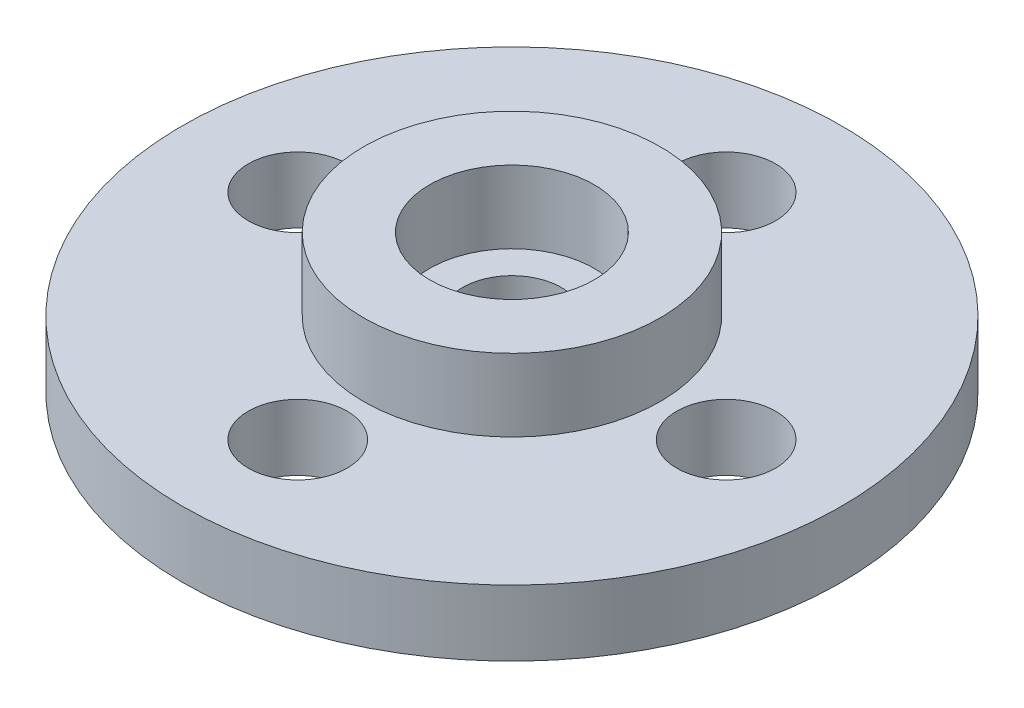
ISO-10303-21;
HEADER;
FILE_DESCRIPTION(('STEP AP214'),'2;1');
FILE_NAME('part.step','',(''),(''),'','','');
FILE_SCHEMA(('AUTOMOTIVE_DESIGN { 1 0 10303 214 1 1 1 1 }'));
ENDSEC;
DATA;
#1=APPLICATION_CONTEXT('core data for automotive mechanical design processes');
#2=APPLICATION_PROTOCOL_DEFINITION('international standard','automotive_design',2000,#1);
#3=PRODUCT_CONTEXT('',#1,'mechanical');
#4=PRODUCT('Part','Part','',(#3));
#5=PRODUCT_RELATED_PRODUCT_CATEGORY('part','',(#4));
#6=PRODUCT_DEFINITION_FORMATION('','',#4);
#7=PRODUCT_DEFINITION_CONTEXT('part definition',#1,'design');
#8=PRODUCT_DEFINITION('design','',#6,#7);
#9=PRODUCT_DEFINITION_SHAPE('','',#8);
#10=(LENGTH_UNIT() NAMED_UNIT(*) SI_UNIT(.MILLI.,.METRE.));
#11=(NAMED_UNIT(*) PLANE_ANGLE_UNIT() SI_UNIT($,.RADIAN.));
#12=(NAMED_UNIT(*) SI_UNIT($,.STERADIAN.) SOLID_ANGLE_UNIT());
#13=UNCERTAINTY_MEASURE_WITH_UNIT(LENGTH_MEASURE(1.E-05),#10,'distance_accuracy_value','');
#14=(GEOMETRIC_REPRESENTATION_CONTEXT(3) GLOBAL_UNCERTAINTY_ASSIGNED_CONTEXT((#13)) GLOBAL_UNIT_ASSIGNED_CONTEXT((#10,
#11,#12)) REPRESENTATION_CONTEXT('',''));
#15=CARTESIAN_POINT('',(0.,0.,0.));
#16=DIRECTION('',(0.,0.,1.));
#17=DIRECTION('',(1.,0.,0.));
#18=AXIS2_PLACEMENT_3D('',#15,#16,#17);
#19=CARTESIAN_POINT('',(0.,4.2,0.));
#20=DIRECTION('',(0.,-1.,0.));
#21=DIRECTION('',(0.,0.,-1.));
#22=AXIS2_PLACEMENT_3D('',#19,#20,#21);
#23=CYLINDRICAL_SURFACE('',#22,1.5);
#24=CARTESIAN_POINT('',(0.,0.,0.));
#25=DIRECTION('',(0.,1.,0.));
#26=DIRECTION('',(0.,0.,1.));
#27=AXIS2_PLACEMENT_3D('',#24,#25,#26);
#28=CIRCLE('',#27,1.5);
#29=CARTESIAN_POINT('',(0.,0.,1.5));
#30=VERTEX_POINT('',#29);
#31=EDGE_CURVE('E45',#30,#30,#28,.T.);
#32=ORIENTED_EDGE('',*,*,#31,.F.);
#33=EDGE_LOOP('',(#32));
#34=FACE_BOUND('',#33,.T.);
#35=CARTESIAN_POINT('',(0.,2.,0.));
#36=DIRECTION('',(0.,1.,0.));
#37=DIRECTION('',(0.,0.,1.));
#38=AXIS2_PLACEMENT_3D('',#35,#36,#37);
#39=CIRCLE('',#38,1.5);
#40=CARTESIAN_POINT('',(0.,2.,1.5));
#41=VERTEX_POINT('',#40);
#42=EDGE_CURVE('E89',#41,#41,#39,.F.);
#43=ORIENTED_EDGE('',*,*,#42,.F.);
#44=EDGE_LOOP('',(#43));
#45=FACE_BOUND('',#44,.T.);
#46=ADVANCED_FACE('F38',(#34,#45),#23,.F.);
#47=CARTESIAN_POINT('',(0.,4.2,0.));
#48=DIRECTION('',(0.,1.,0.));
#49=DIRECTION('',(0.,0.,1.));
#50=AXIS2_PLACEMENT_3D('',#47,#48,#49);
#51=PLANE('',#50);
#52=CARTESIAN_POINT('',(0.,4.2,0.));
#53=DIRECTION('',(0.,1.,0.));
#54=DIRECTION('',(0.,0.,1.));
#55=AXIS2_PLACEMENT_3D('',#52,#53,#54);
#56=CIRCLE('',#55,2.5);
#57=CARTESIAN_POINT('',(0.,4.2,2.5));
#58=VERTEX_POINT('',#57);
#59=EDGE_CURVE('E86',#58,#58,#56,.T.);
#60=ORIENTED_EDGE('',*,*,#59,.F.);
#61=EDGE_LOOP('',(#60));
#62=FACE_BOUND('',#61,.T.);
#63=CARTESIAN_POINT('',(0.,4.2,0.));
#64=DIRECTION('',(0.,1.,0.));
#65=DIRECTION('',(0.,0.,1.));
#66=AXIS2_PLACEMENT_3D('',#63,#64,#65);
#67=CIRCLE('',#66,4.5);
#68=CARTESIAN_POINT('',(0.,4.2,4.5));
#69=VERTEX_POINT('',#68);
#70=EDGE_CURVE('E65',#69,#69,#67,.T.);
#71=ORIENTED_EDGE('',*,*,#70,.T.);
#72=EDGE_LOOP('',(#71));
#73=FACE_BOUND('',#72,.T.);
#74=ADVANCED_FACE('F99',(#62,#73),#51,.T.);
#75=CARTESIAN_POINT('',(0.,4.2,0.));
#76=DIRECTION('',(0.,-1.,0.));
#77=DIRECTION('',(0.,0.,-1.));
#78=AXIS2_PLACEMENT_3D('',#75,#76,#77);
#79=CYLINDRICAL_SURFACE('',#78,10.);
#80=CARTESIAN_POINT('',(0.,0.,0.));
#81=DIRECTION('',(0.,1.,0.));
#82=DIRECTION('',(0.,0.,1.));
#83=AXIS2_PLACEMENT_3D('',#80,#81,#82);
#84=CIRCLE('',#83,10.);
#85=CARTESIAN_POINT('',(0.,0.,10.));
#86=VERTEX_POINT('',#85);
#87=EDGE_CURVE('E11',#86,#86,#84,.T.);
#88=ORIENTED_EDGE('',*,*,#87,.T.);
#89=EDGE_LOOP('',(#88));
#90=FACE_BOUND('',#89,.T.);
#91=CARTESIAN_POINT('',(0.,2.,0.));
#92=DIRECTION('',(0.,1.,0.));
#93=DIRECTION('',(0.,0.,1.));
#94=AXIS2_PLACEMENT_3D('',#91,#92,#93);
#95=CIRCLE('',#94,10.);
#96=CARTESIAN_POINT('',(0.,2.,10.));
#97=VERTEX_POINT('',#96);
#98=EDGE_CURVE('E72',#97,#97,#95,.T.);
#99=ORIENTED_EDGE('',*,*,#98,.F.);
#100=EDGE_LOOP('',(#99));
#101=FACE_BOUND('',#100,.T.);
#102=ADVANCED_FACE('F40',(#90,#101),#79,.T.);
#103=CARTESIAN_POINT('',(0.,4.2,-6.5));
#104=DIRECTION('',(0.,-1.,0.));
#105=DIRECTION('',(0.,0.,-1.));
#106=AXIS2_PLACEMENT_3D('',#103,#104,#105);
#107=CYLINDRICAL_SURFACE('',#106,1.5);
#108=CARTESIAN_POINT('',(0.,0.,-6.5));
#109=DIRECTION('',(0.,1.,0.));
#110=DIRECTION('',(0.,0.,1.));
#111=AXIS2_PLACEMENT_3D('',#108,#109,#110);
#112=CIRCLE('',#111,1.5);
#113=CARTESIAN_POINT('',(0.,0.,-5.));
#114=VERTEX_POINT('',#113);
#115=EDGE_CURVE('E49',#114,#114,#112,.T.);
#116=ORIENTED_EDGE('',*,*,#115,.F.);
#117=EDGE_LOOP('',(#116));
#118=FACE_BOUND('',#117,.T.);
#119=CARTESIAN_POINT('',(0.,2.,-6.5));
#120=DIRECTION('',(0.,1.,0.));
#121=DIRECTION('',(0.,0.,1.));
#122=AXIS2_PLACEMENT_3D('',#119,#120,#121);
#123=CIRCLE('',#122,1.5);
#124=CARTESIAN_POINT('',(0.,2.,-5.));
#125=VERTEX_POINT('',#124);
#126=EDGE_CURVE('E81',#125,#125,#123,.F.);
#127=ORIENTED_EDGE('',*,*,#126,.F.);
#128=EDGE_LOOP('',(#127));
#129=FACE_BOUND('',#128,.T.);
#130=ADVANCED_FACE('F108',(#118,#129),#107,.F.);
#131=CARTESIAN_POINT('',(0.,4.2,6.5));
#132=DIRECTION('',(0.,-1.,0.));
#133=DIRECTION('',(0.,0.,-1.));
#134=AXIS2_PLACEMENT_3D('',#131,#132,#133);
#135=CYLINDRICAL_SURFACE('',#134,1.5);
#136=CARTESIAN_POINT('',(0.,0.,6.5));
#137=DIRECTION('',(0.,1.,0.));
#138=DIRECTION('',(0.,0.,-1.));
#139=AXIS2_PLACEMENT_3D('',#136,#137,#138);
#140=CIRCLE('',#139,1.5);
#141=CARTESIAN_POINT('',(0.,0.,5.));
#142=VERTEX_POINT('',#141);
#143=EDGE_CURVE('E53',#142,#142,#140,.T.);
#144=ORIENTED_EDGE('',*,*,#143,.F.);
#145=EDGE_LOOP('',(#144));
#146=FACE_BOUND('',#145,.T.);
#147=CARTESIAN_POINT('',(0.,2.,6.5));
#148=DIRECTION('',(0.,1.,0.));
#149=DIRECTION('',(0.,0.,1.));
#150=AXIS2_PLACEMENT_3D('',#147,#148,#149);
#151=CIRCLE('',#150,1.5);
#152=CARTESIAN_POINT('',(0.,2.,8.));
#153=VERTEX_POINT('',#152);
#154=EDGE_CURVE('E75',#153,#153,#151,.F.);
#155=ORIENTED_EDGE('',*,*,#154,.F.);
#156=EDGE_LOOP('',(#155));
#157=FACE_BOUND('',#156,.T.);
#158=ADVANCED_FACE('F148',(#146,#157),#135,.F.);
#159=CARTESIAN_POINT('',(6.5,4.2,0.));
#160=DIRECTION('',(0.,-1.,0.));
#161=DIRECTION('',(0.,0.,-1.));
#162=AXIS2_PLACEMENT_3D('',#159,#160,#161);
#163=CYLINDRICAL_SURFACE('',#162,1.5);
#164=CARTESIAN_POINT('',(6.5,0.,0.));
#165=DIRECTION('',(0.,1.,0.));
#166=DIRECTION('',(0.,0.,1.));
#167=AXIS2_PLACEMENT_3D('',#164,#165,#166);
#168=CIRCLE('',#167,1.5);
#169=CARTESIAN_POINT('',(6.5,0.,1.5));
#170=VERTEX_POINT('',#169);
#171=EDGE_CURVE('E58',#170,#170,#168,.T.);
#172=ORIENTED_EDGE('',*,*,#171,.F.);
#173=EDGE_LOOP('',(#172));
#174=FACE_BOUND('',#173,.T.);
#175=CARTESIAN_POINT('',(6.5,2.,0.));
#176=DIRECTION('',(0.,1.,0.));
#177=DIRECTION('',(0.,0.,1.));
#178=AXIS2_PLACEMENT_3D('',#175,#176,#177);
#179=CIRCLE('',#178,1.5);
#180=CARTESIAN_POINT('',(6.5,2.,1.5));
#181=VERTEX_POINT('',#180);
#182=EDGE_CURVE('E64',#181,#181,#179,.F.);
#183=ORIENTED_EDGE('',*,*,#182,.F.);
#184=EDGE_LOOP('',(#183));
#185=FACE_BOUND('',#184,.T.);
#186=ADVANCED_FACE('F122',(#174,#185),#163,.F.);
#187=CARTESIAN_POINT('',(-6.5,4.2,0.));
#188=DIRECTION('',(0.,-1.,0.));
#189=DIRECTION('',(0.,0.,-1.));
#190=AXIS2_PLACEMENT_3D('',#187,#188,#189);
#191=CYLINDRICAL_SURFACE('',#190,1.5);
#192=CARTESIAN_POINT('',(-6.5,0.,0.));
#193=DIRECTION('',(0.,1.,0.));
#194=DIRECTION('',(0.,0.,-1.));
#195=AXIS2_PLACEMENT_3D('',#192,#193,#194);
#196=CIRCLE('',#195,1.5);
#197=CARTESIAN_POINT('',(-6.5,0.,-1.5));
#198=VERTEX_POINT('',#197);
#199=EDGE_CURVE('E61',#198,#198,#196,.T.);
#200=ORIENTED_EDGE('',*,*,#199,.F.);
#201=EDGE_LOOP('',(#200));
#202=FACE_BOUND('',#201,.T.);
#203=CARTESIAN_POINT('',(-6.5,2.,0.));
#204=DIRECTION('',(0.,1.,0.));
#205=DIRECTION('',(0.,0.,1.));
#206=AXIS2_PLACEMENT_3D('',#203,#204,#205);
#207=CIRCLE('',#206,1.5);
#208=CARTESIAN_POINT('',(-6.5,2.,1.5));
#209=VERTEX_POINT('',#208);
#210=EDGE_CURVE('E78',#209,#209,#207,.F.);
#211=ORIENTED_EDGE('',*,*,#210,.F.);
#212=EDGE_LOOP('',(#211));
#213=FACE_BOUND('',#212,.T.);
#214=ADVANCED_FACE('F113',(#202,#213),#191,.F.);
#215=CARTESIAN_POINT('',(0.,0.,0.));
#216=DIRECTION('',(0.,1.,0.));
#217=DIRECTION('',(0.,0.,1.));
#218=AXIS2_PLACEMENT_3D('',#215,#216,#217);
#219=PLANE('',#218);
#220=ORIENTED_EDGE('',*,*,#171,.T.);
#221=EDGE_LOOP('',(#220));
#222=FACE_BOUND('',#221,.T.);
#223=ORIENTED_EDGE('',*,*,#115,.T.);
#224=EDGE_LOOP('',(#223));
#225=FACE_BOUND('',#224,.T.);
#226=ORIENTED_EDGE('',*,*,#87,.F.);
#227=EDGE_LOOP('',(#226));
#228=FACE_BOUND('',#227,.T.);
#229=ORIENTED_EDGE('',*,*,#31,.T.);
#230=EDGE_LOOP('',(#229));
#231=FACE_BOUND('',#230,.T.);
#232=ORIENTED_EDGE('',*,*,#143,.T.);
#233=EDGE_LOOP('',(#232));
#234=FACE_BOUND('',#233,.T.);
#235=ORIENTED_EDGE('',*,*,#199,.T.);
#236=EDGE_LOOP('',(#235));
#237=FACE_BOUND('',#236,.T.);
#238=ADVANCED_FACE('F110',(#222,#225,#228,#231,#234,#237),#219,.F.);
#239=CARTESIAN_POINT('',(0.,2.,0.));
#240=DIRECTION('',(0.,1.,0.));
#241=DIRECTION('',(0.,0.,1.));
#242=AXIS2_PLACEMENT_3D('',#239,#240,#241);
#243=CYLINDRICAL_SURFACE('',#242,4.5);
#244=CARTESIAN_POINT('',(0.,2.,0.));
#245=DIRECTION('',(0.,1.,0.));
#246=DIRECTION('',(0.,0.,1.));
#247=AXIS2_PLACEMENT_3D('',#244,#245,#246);
#248=CIRCLE('',#247,4.5);
#249=CARTESIAN_POINT('',(0.,2.,4.5));
#250=VERTEX_POINT('',#249);
#251=EDGE_CURVE('E68',#250,#250,#248,.T.);
#252=ORIENTED_EDGE('',*,*,#251,.T.);
#253=EDGE_LOOP('',(#252));
#254=FACE_BOUND('',#253,.T.);
#255=ORIENTED_EDGE('',*,*,#70,.F.);
#256=EDGE_LOOP('',(#255));
#257=FACE_BOUND('',#256,.T.);
#258=ADVANCED_FACE('F112',(#254,#257),#243,.T.);
#259=CARTESIAN_POINT('',(0.,2.,0.));
#260=DIRECTION('',(0.,1.,0.));
#261=DIRECTION('',(0.,0.,1.));
#262=AXIS2_PLACEMENT_3D('',#259,#260,#261);
#263=PLANE('',#262);
#264=ORIENTED_EDGE('',*,*,#251,.F.);
#265=EDGE_LOOP('',(#264));
#266=FACE_BOUND('',#265,.T.);
#267=ORIENTED_EDGE('',*,*,#126,.T.);
#268=EDGE_LOOP('',(#267));
#269=FACE_BOUND('',#268,.T.);
#270=ORIENTED_EDGE('',*,*,#210,.T.);
#271=EDGE_LOOP('',(#270));
#272=FACE_BOUND('',#271,.T.);
#273=ORIENTED_EDGE('',*,*,#154,.T.);
#274=EDGE_LOOP('',(#273));
#275=FACE_BOUND('',#274,.T.);
#276=ORIENTED_EDGE('',*,*,#98,.T.);
#277=EDGE_LOOP('',(#276));
#278=FACE_BOUND('',#277,.T.);
#279=ORIENTED_EDGE('',*,*,#182,.T.);
#280=EDGE_LOOP('',(#279));
#281=FACE_BOUND('',#280,.T.);
#282=ADVANCED_FACE('F119',(#266,#269,#272,#275,#278,#281),#263,.T.);
#283=CARTESIAN_POINT('',(0.,2.,0.));
#284=DIRECTION('',(0.,1.,0.));
#285=DIRECTION('',(0.,0.,1.));
#286=AXIS2_PLACEMENT_3D('',#283,#284,#285);
#287=CYLINDRICAL_SURFACE('',#286,2.5);
#288=CARTESIAN_POINT('',(0.,2.,0.));
#289=DIRECTION('',(0.,1.,0.));
#290=DIRECTION('',(0.,0.,1.));
#291=AXIS2_PLACEMENT_3D('',#288,#289,#290);
#292=CIRCLE('',#291,2.5);
#293=CARTESIAN_POINT('',(0.,2.,2.5));
#294=VERTEX_POINT('',#293);
#295=EDGE_CURVE('E69',#294,#294,#292,.T.);
#296=ORIENTED_EDGE('',*,*,#295,.F.);
#297=EDGE_LOOP('',(#296));
#298=FACE_BOUND('',#297,.T.);
#299=ORIENTED_EDGE('',*,*,#59,.T.);
#300=EDGE_LOOP('',(#299));
#301=FACE_BOUND('',#300,.T.);
#302=ADVANCED_FACE('F138',(#298,#301),#287,.F.);
#303=CARTESIAN_POINT('',(0.,2.,0.));
#304=DIRECTION('',(0.,1.,0.));
#305=DIRECTION('',(0.,0.,1.));
#306=AXIS2_PLACEMENT_3D('',#303,#304,#305);
#307=PLANE('',#306);
#308=ORIENTED_EDGE('',*,*,#42,.T.);
#309=EDGE_LOOP('',(#308));
#310=FACE_BOUND('',#309,.T.);
#311=ORIENTED_EDGE('',*,*,#295,.T.);
#312=EDGE_LOOP('',(#311));
#313=FACE_BOUND('',#312,.T.);
#314=ADVANCED_FACE('F95',(#310,#313),#307,.T.);
#315=CLOSED_SHELL('',(#46,#74,#102,#130,#158,#186,#214,#238,#258,#282,#302,#314));
#316=MANIFOLD_SOLID_BREP('B2',#315);
#317=ADVANCED_BREP_SHAPE_REPRESENTATION('',(#18,#316),#14);
#318=SHAPE_DEFINITION_REPRESENTATION(#9,#317);
ENDSEC;
END-ISO-10303-21;
